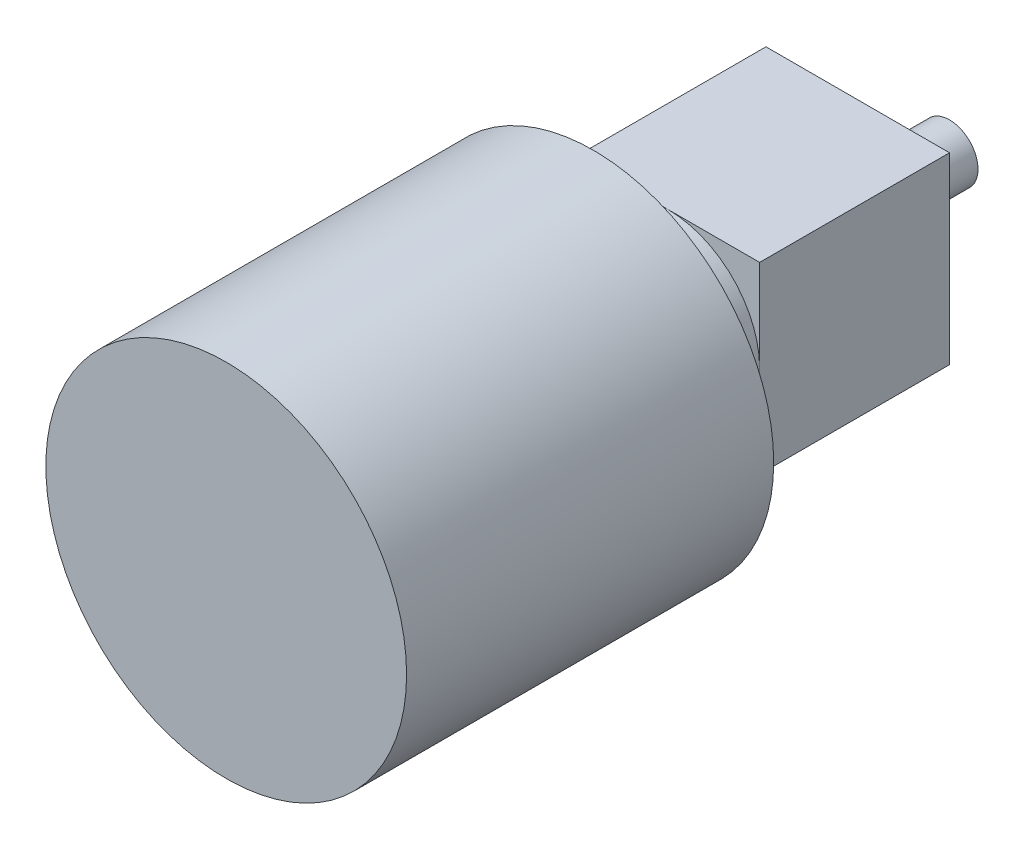
ISO-10303-21;
HEADER;
FILE_DESCRIPTION(('STEP AP214'),'2;1');
FILE_NAME('part.step','',(''),(''),'','','');
FILE_SCHEMA(('AUTOMOTIVE_DESIGN { 1 0 10303 214 1 1 1 1 }'));
ENDSEC;
DATA;
#1=APPLICATION_CONTEXT('core data for automotive mechanical design processes');
#2=APPLICATION_PROTOCOL_DEFINITION('international standard','automotive_design',2000,#1);
#3=PRODUCT_CONTEXT('',#1,'mechanical');
#4=PRODUCT('Part','Part','',(#3));
#5=PRODUCT_RELATED_PRODUCT_CATEGORY('part','',(#4));
#6=PRODUCT_DEFINITION_FORMATION('','',#4);
#7=PRODUCT_DEFINITION_CONTEXT('part definition',#1,'design');
#8=PRODUCT_DEFINITION('design','',#6,#7);
#9=PRODUCT_DEFINITION_SHAPE('','',#8);
#10=(LENGTH_UNIT() NAMED_UNIT(*) SI_UNIT(.MILLI.,.METRE.));
#11=(NAMED_UNIT(*) PLANE_ANGLE_UNIT() SI_UNIT($,.RADIAN.));
#12=(NAMED_UNIT(*) SI_UNIT($,.STERADIAN.) SOLID_ANGLE_UNIT());
#13=UNCERTAINTY_MEASURE_WITH_UNIT(LENGTH_MEASURE(1.E-05),#10,'distance_accuracy_value','');
#14=(GEOMETRIC_REPRESENTATION_CONTEXT(3) GLOBAL_UNCERTAINTY_ASSIGNED_CONTEXT((#13)) GLOBAL_UNIT_ASSIGNED_CONTEXT((#10,
#11,#12)) REPRESENTATION_CONTEXT('',''));
#15=CARTESIAN_POINT('',(0.,0.,0.));
#16=DIRECTION('',(0.,0.,1.));
#17=DIRECTION('',(1.,0.,0.));
#18=AXIS2_PLACEMENT_3D('',#15,#16,#17);
#19=CARTESIAN_POINT('',(14.5,29.,15.));
#20=DIRECTION('',(0.,0.,-1.));
#21=DIRECTION('',(-1.,0.,0.));
#22=AXIS2_PLACEMENT_3D('',#19,#20,#21);
#23=PLANE('',#22);
#24=CARTESIAN_POINT('',(0.,14.5,15.));
#25=DIRECTION('',(0.,0.,1.));
#26=DIRECTION('',(1.,0.,0.));
#27=AXIS2_PLACEMENT_3D('',#24,#25,#26);
#28=CIRCLE('',#27,14.5);
#29=CARTESIAN_POINT('',(14.5,14.5,15.));
#30=VERTEX_POINT('',#29);
#31=CARTESIAN_POINT('',(0.,29.,15.));
#32=VERTEX_POINT('',#31);
#33=EDGE_CURVE('E108',#30,#32,#28,.T.);
#34=ORIENTED_EDGE('',*,*,#33,.F.);
#35=DIRECTION('',(0.,-1.,0.));
#36=VECTOR('',#35,1.);
#37=CARTESIAN_POINT('',(14.5,29.,15.));
#38=LINE('',#37,#36);
#39=CARTESIAN_POINT('',(14.5,29.,15.));
#40=VERTEX_POINT('',#39);
#41=EDGE_CURVE('E88',#40,#30,#38,.T.);
#42=ORIENTED_EDGE('',*,*,#41,.F.);
#43=DIRECTION('',(1.,0.,0.));
#44=VECTOR('',#43,1.);
#45=CARTESIAN_POINT('',(14.5,29.,15.));
#46=LINE('',#45,#44);
#47=EDGE_CURVE('E109',#32,#40,#46,.T.);
#48=ORIENTED_EDGE('',*,*,#47,.F.);
#49=EDGE_LOOP('',(#34,#42,#48));
#50=FACE_BOUND('',#49,.T.);
#51=ADVANCED_FACE('F34',(#50),#23,.F.);
#52=CARTESIAN_POINT('',(-14.5,14.5,15.));
#53=VERTEX_POINT('',#52);
#54=EDGE_CURVE('E42',#32,#53,#28,.T.);
#55=ORIENTED_EDGE('',*,*,#54,.F.);
#56=CARTESIAN_POINT('',(-14.5,29.,15.));
#57=VERTEX_POINT('',#56);
#58=EDGE_CURVE('E124',#57,#32,#46,.T.);
#59=ORIENTED_EDGE('',*,*,#58,.F.);
#60=DIRECTION('',(0.,-1.,0.));
#61=VECTOR('',#60,1.);
#62=CARTESIAN_POINT('',(-14.5,29.,15.));
#63=LINE('',#62,#61);
#64=EDGE_CURVE('E116',#57,#53,#63,.T.);
#65=ORIENTED_EDGE('',*,*,#64,.T.);
#66=EDGE_LOOP('',(#55,#59,#65));
#67=FACE_BOUND('',#66,.T.);
#68=ADVANCED_FACE('F155',(#67),#23,.F.);
#69=CARTESIAN_POINT('',(0.,0.,15.));
#70=VERTEX_POINT('',#69);
#71=EDGE_CURVE('E49',#53,#70,#28,.T.);
#72=ORIENTED_EDGE('',*,*,#71,.F.);
#73=CARTESIAN_POINT('',(-14.5,0.,15.));
#74=VERTEX_POINT('',#73);
#75=EDGE_CURVE('E97',#53,#74,#63,.T.);
#76=ORIENTED_EDGE('',*,*,#75,.T.);
#77=DIRECTION('',(1.,0.,0.));
#78=VECTOR('',#77,1.);
#79=CARTESIAN_POINT('',(14.5,0.,15.));
#80=LINE('',#79,#78);
#81=EDGE_CURVE('E133',#74,#70,#80,.T.);
#82=ORIENTED_EDGE('',*,*,#81,.T.);
#83=EDGE_LOOP('',(#72,#76,#82));
#84=FACE_BOUND('',#83,.T.);
#85=ADVANCED_FACE('F157',(#84),#23,.F.);
#86=CARTESIAN_POINT('',(-14.5,29.,15.));
#87=DIRECTION('',(1.,0.,0.));
#88=DIRECTION('',(0.,0.,-1.));
#89=AXIS2_PLACEMENT_3D('',#86,#87,#88);
#90=PLANE('',#89);
#91=DIRECTION('',(0.,0.,1.));
#92=VECTOR('',#91,1.);
#93=CARTESIAN_POINT('',(-14.5,0.,15.));
#94=LINE('',#93,#92);
#95=CARTESIAN_POINT('',(-14.5,0.,-15.));
#96=VERTEX_POINT('',#95);
#97=EDGE_CURVE('E130',#96,#74,#94,.T.);
#98=ORIENTED_EDGE('',*,*,#97,.T.);
#99=ORIENTED_EDGE('',*,*,#75,.F.);
#100=ORIENTED_EDGE('',*,*,#64,.F.);
#101=DIRECTION('',(0.,0.,1.));
#102=VECTOR('',#101,1.);
#103=CARTESIAN_POINT('',(-14.5,29.,15.));
#104=LINE('',#103,#102);
#105=CARTESIAN_POINT('',(-14.5,29.,-15.));
#106=VERTEX_POINT('',#105);
#107=EDGE_CURVE('E120',#106,#57,#104,.T.);
#108=ORIENTED_EDGE('',*,*,#107,.F.);
#109=DIRECTION('',(0.,-1.,0.));
#110=VECTOR('',#109,1.);
#111=CARTESIAN_POINT('',(-14.5,29.,-15.));
#112=LINE('',#111,#110);
#113=EDGE_CURVE('E129',#106,#96,#112,.T.);
#114=ORIENTED_EDGE('',*,*,#113,.T.);
#115=EDGE_LOOP('',(#98,#99,#100,#108,#114));
#116=FACE_BOUND('',#115,.T.);
#117=ADVANCED_FACE('F36',(#116),#90,.F.);
#118=EDGE_CURVE('E102',#70,#30,#28,.T.);
#119=ORIENTED_EDGE('',*,*,#118,.F.);
#120=CARTESIAN_POINT('',(14.5,0.,15.));
#121=VERTEX_POINT('',#120);
#122=EDGE_CURVE('E104',#70,#121,#80,.T.);
#123=ORIENTED_EDGE('',*,*,#122,.T.);
#124=EDGE_CURVE('E91',#30,#121,#38,.T.);
#125=ORIENTED_EDGE('',*,*,#124,.F.);
#126=EDGE_LOOP('',(#119,#123,#125));
#127=FACE_BOUND('',#126,.T.);
#128=ADVANCED_FACE('F100',(#127),#23,.F.);
#129=CARTESIAN_POINT('',(14.5,29.,15.));
#130=DIRECTION('',(-1.,0.,0.));
#131=DIRECTION('',(0.,0.,1.));
#132=AXIS2_PLACEMENT_3D('',#129,#130,#131);
#133=PLANE('',#132);
#134=DIRECTION('',(0.,0.,-1.));
#135=VECTOR('',#134,1.);
#136=CARTESIAN_POINT('',(14.5,0.,15.));
#137=LINE('',#136,#135);
#138=CARTESIAN_POINT('',(14.5,0.,-15.));
#139=VERTEX_POINT('',#138);
#140=EDGE_CURVE('E135',#121,#139,#137,.T.);
#141=ORIENTED_EDGE('',*,*,#140,.T.);
#142=DIRECTION('',(0.,-1.,0.));
#143=VECTOR('',#142,1.);
#144=CARTESIAN_POINT('',(14.5,29.,-15.));
#145=LINE('',#144,#143);
#146=CARTESIAN_POINT('',(14.5,29.,-15.));
#147=VERTEX_POINT('',#146);
#148=EDGE_CURVE('E106',#147,#139,#145,.T.);
#149=ORIENTED_EDGE('',*,*,#148,.F.);
#150=DIRECTION('',(0.,0.,-1.));
#151=VECTOR('',#150,1.);
#152=CARTESIAN_POINT('',(14.5,29.,15.));
#153=LINE('',#152,#151);
#154=EDGE_CURVE('E94',#40,#147,#153,.T.);
#155=ORIENTED_EDGE('',*,*,#154,.F.);
#156=ORIENTED_EDGE('',*,*,#41,.T.);
#157=ORIENTED_EDGE('',*,*,#124,.T.);
#158=EDGE_LOOP('',(#141,#149,#155,#156,#157));
#159=FACE_BOUND('',#158,.T.);
#160=ADVANCED_FACE('F90',(#159),#133,.F.);
#161=CARTESIAN_POINT('',(14.5,29.,-15.));
#162=DIRECTION('',(0.,0.,1.));
#163=DIRECTION('',(1.,0.,0.));
#164=AXIS2_PLACEMENT_3D('',#161,#162,#163);
#165=PLANE('',#164);
#166=CARTESIAN_POINT('',(8.5,23.,-15.));
#167=DIRECTION('',(0.,0.,1.));
#168=DIRECTION('',(1.,0.,0.));
#169=AXIS2_PLACEMENT_3D('',#166,#167,#168);
#170=CIRCLE('',#169,4.5);
#171=CARTESIAN_POINT('',(13.,23.,-15.));
#172=VERTEX_POINT('',#171);
#173=EDGE_CURVE('E11',#172,#172,#170,.F.);
#174=ORIENTED_EDGE('',*,*,#173,.F.);
#175=EDGE_LOOP('',(#174));
#176=FACE_BOUND('',#175,.T.);
#177=DIRECTION('',(-1.,0.,0.));
#178=VECTOR('',#177,1.);
#179=CARTESIAN_POINT('',(14.5,0.,-15.));
#180=LINE('',#179,#178);
#181=EDGE_CURVE('E123',#139,#96,#180,.T.);
#182=ORIENTED_EDGE('',*,*,#181,.T.);
#183=ORIENTED_EDGE('',*,*,#113,.F.);
#184=DIRECTION('',(-1.,0.,0.));
#185=VECTOR('',#184,1.);
#186=CARTESIAN_POINT('',(14.5,29.,-15.));
#187=LINE('',#186,#185);
#188=EDGE_CURVE('E127',#147,#106,#187,.T.);
#189=ORIENTED_EDGE('',*,*,#188,.F.);
#190=ORIENTED_EDGE('',*,*,#148,.T.);
#191=EDGE_LOOP('',(#182,#183,#189,#190));
#192=FACE_BOUND('',#191,.T.);
#193=ADVANCED_FACE('F144',(#176,#192),#165,.F.);
#194=CARTESIAN_POINT('',(0.,29.,0.));
#195=DIRECTION('',(0.,1.,0.));
#196=DIRECTION('',(0.,0.,1.));
#197=AXIS2_PLACEMENT_3D('',#194,#195,#196);
#198=PLANE('',#197);
#199=ORIENTED_EDGE('',*,*,#107,.T.);
#200=ORIENTED_EDGE('',*,*,#58,.T.);
#201=ORIENTED_EDGE('',*,*,#47,.T.);
#202=ORIENTED_EDGE('',*,*,#154,.T.);
#203=ORIENTED_EDGE('',*,*,#188,.T.);
#204=EDGE_LOOP('',(#199,#200,#201,#202,#203));
#205=FACE_BOUND('',#204,.T.);
#206=ADVANCED_FACE('F154',(#205),#198,.T.);
#207=CARTESIAN_POINT('',(0.,0.,0.));
#208=DIRECTION('',(0.,1.,0.));
#209=DIRECTION('',(0.,0.,1.));
#210=AXIS2_PLACEMENT_3D('',#207,#208,#209);
#211=PLANE('',#210);
#212=CARTESIAN_POINT('',(10.,0.,12.));
#213=DIRECTION('',(0.,-1.,0.));
#214=DIRECTION('',(0.,0.,-1.));
#215=AXIS2_PLACEMENT_3D('',#212,#213,#214);
#216=CIRCLE('',#215,1.2);
#217=CARTESIAN_POINT('',(10.,0.,10.8));
#218=VERTEX_POINT('',#217);
#219=EDGE_CURVE('E238',#218,#218,#216,.T.);
#220=ORIENTED_EDGE('',*,*,#219,.F.);
#221=EDGE_LOOP('',(#220));
#222=FACE_BOUND('',#221,.T.);
#223=CARTESIAN_POINT('',(0.,0.,-11.5));
#224=DIRECTION('',(0.,-1.,0.));
#225=DIRECTION('',(0.,0.,-1.));
#226=AXIS2_PLACEMENT_3D('',#223,#224,#225);
#227=CIRCLE('',#226,1.2);
#228=CARTESIAN_POINT('',(0.,0.,-12.7));
#229=VERTEX_POINT('',#228);
#230=EDGE_CURVE('E229',#229,#229,#227,.T.);
#231=ORIENTED_EDGE('',*,*,#230,.F.);
#232=EDGE_LOOP('',(#231));
#233=FACE_BOUND('',#232,.T.);
#234=CARTESIAN_POINT('',(-10.,0.,12.));
#235=DIRECTION('',(0.,-1.,0.));
#236=DIRECTION('',(0.,0.,-1.));
#237=AXIS2_PLACEMENT_3D('',#234,#235,#236);
#238=CIRCLE('',#237,1.2);
#239=CARTESIAN_POINT('',(-10.,0.,10.8));
#240=VERTEX_POINT('',#239);
#241=EDGE_CURVE('E237',#240,#240,#238,.T.);
#242=ORIENTED_EDGE('',*,*,#241,.F.);
#243=EDGE_LOOP('',(#242));
#244=FACE_BOUND('',#243,.T.);
#245=ORIENTED_EDGE('',*,*,#97,.F.);
#246=ORIENTED_EDGE('',*,*,#181,.F.);
#247=ORIENTED_EDGE('',*,*,#140,.F.);
#248=ORIENTED_EDGE('',*,*,#122,.F.);
#249=ORIENTED_EDGE('',*,*,#81,.F.);
#250=EDGE_LOOP('',(#245,#246,#247,#248,#249));
#251=FACE_BOUND('',#250,.T.);
#252=ADVANCED_FACE('F148',(#222,#233,#244,#251),#211,.F.);
#253=CARTESIAN_POINT('',(0.,14.5,26.78));
#254=DIRECTION('',(0.,0.,-1.));
#255=DIRECTION('',(-1.,0.,0.));
#256=AXIS2_PLACEMENT_3D('',#253,#254,#255);
#257=CYLINDRICAL_SURFACE('',#256,14.5);
#258=CARTESIAN_POINT('',(0.,14.5,26.78));
#259=DIRECTION('',(0.,0.,1.));
#260=DIRECTION('',(1.,0.,0.));
#261=AXIS2_PLACEMENT_3D('',#258,#259,#260);
#262=CIRCLE('',#261,14.5);
#263=CARTESIAN_POINT('',(14.5,14.5,26.78));
#264=VERTEX_POINT('',#263);
#265=EDGE_CURVE('E112',#264,#264,#262,.T.);
#266=ORIENTED_EDGE('',*,*,#265,.F.);
#267=EDGE_LOOP('',(#266));
#268=FACE_BOUND('',#267,.T.);
#269=ORIENTED_EDGE('',*,*,#33,.T.);
#270=ORIENTED_EDGE('',*,*,#54,.T.);
#271=ORIENTED_EDGE('',*,*,#71,.T.);
#272=ORIENTED_EDGE('',*,*,#118,.T.);
#273=EDGE_LOOP('',(#269,#270,#271,#272));
#274=FACE_BOUND('',#273,.T.);
#275=ADVANCED_FACE('F115',(#268,#274),#257,.T.);
#276=CARTESIAN_POINT('',(-10.,2.5,12.));
#277=DIRECTION('',(0.,-1.,0.));
#278=DIRECTION('',(0.,0.,-1.));
#279=AXIS2_PLACEMENT_3D('',#276,#277,#278);
#280=CYLINDRICAL_SURFACE('',#279,1.2);
#281=CARTESIAN_POINT('',(-10.,2.5,12.));
#282=DIRECTION('',(0.,-1.,0.));
#283=DIRECTION('',(0.,0.,-1.));
#284=AXIS2_PLACEMENT_3D('',#281,#282,#283);
#285=CIRCLE('',#284,1.2);
#286=CARTESIAN_POINT('',(-10.,2.5,10.8));
#287=VERTEX_POINT('',#286);
#288=EDGE_CURVE('E113',#287,#287,#285,.T.);
#289=ORIENTED_EDGE('',*,*,#288,.F.);
#290=EDGE_LOOP('',(#289));
#291=FACE_BOUND('',#290,.T.);
#292=ORIENTED_EDGE('',*,*,#241,.T.);
#293=EDGE_LOOP('',(#292));
#294=FACE_BOUND('',#293,.T.);
#295=ADVANCED_FACE('F176',(#291,#294),#280,.F.);
#296=CARTESIAN_POINT('',(-10.,2.5,12.));
#297=DIRECTION('',(0.,-1.,0.));
#298=DIRECTION('',(0.,0.,-1.));
#299=AXIS2_PLACEMENT_3D('',#296,#297,#298);
#300=PLANE('',#299);
#301=ORIENTED_EDGE('',*,*,#288,.T.);
#302=EDGE_LOOP('',(#301));
#303=FACE_BOUND('',#302,.T.);
#304=ADVANCED_FACE('F180',(#303),#300,.T.);
#305=CARTESIAN_POINT('',(0.,2.5,-11.5));
#306=DIRECTION('',(0.,-1.,0.));
#307=DIRECTION('',(0.,0.,-1.));
#308=AXIS2_PLACEMENT_3D('',#305,#306,#307);
#309=CYLINDRICAL_SURFACE('',#308,1.2);
#310=CARTESIAN_POINT('',(0.,2.5,-11.5));
#311=DIRECTION('',(0.,-1.,0.));
#312=DIRECTION('',(0.,0.,-1.));
#313=AXIS2_PLACEMENT_3D('',#310,#311,#312);
#314=CIRCLE('',#313,1.2);
#315=CARTESIAN_POINT('',(0.,2.5,-12.7));
#316=VERTEX_POINT('',#315);
#317=EDGE_CURVE('E241',#316,#316,#314,.T.);
#318=ORIENTED_EDGE('',*,*,#317,.F.);
#319=EDGE_LOOP('',(#318));
#320=FACE_BOUND('',#319,.T.);
#321=ORIENTED_EDGE('',*,*,#230,.T.);
#322=EDGE_LOOP('',(#321));
#323=FACE_BOUND('',#322,.T.);
#324=ADVANCED_FACE('F184',(#320,#323),#309,.F.);
#325=CARTESIAN_POINT('',(0.,2.5,-11.5));
#326=DIRECTION('',(0.,-1.,0.));
#327=DIRECTION('',(0.,0.,-1.));
#328=AXIS2_PLACEMENT_3D('',#325,#326,#327);
#329=PLANE('',#328);
#330=ORIENTED_EDGE('',*,*,#317,.T.);
#331=EDGE_LOOP('',(#330));
#332=FACE_BOUND('',#331,.T.);
#333=ADVANCED_FACE('F188',(#332),#329,.T.);
#334=CARTESIAN_POINT('',(10.,2.5,12.));
#335=DIRECTION('',(0.,-1.,0.));
#336=DIRECTION('',(0.,0.,-1.));
#337=AXIS2_PLACEMENT_3D('',#334,#335,#336);
#338=CYLINDRICAL_SURFACE('',#337,1.2);
#339=CARTESIAN_POINT('',(10.,2.5,12.));
#340=DIRECTION('',(0.,-1.,0.));
#341=DIRECTION('',(0.,0.,-1.));
#342=AXIS2_PLACEMENT_3D('',#339,#340,#341);
#343=CIRCLE('',#342,1.2);
#344=CARTESIAN_POINT('',(10.,2.5,10.8));
#345=VERTEX_POINT('',#344);
#346=EDGE_CURVE('E234',#345,#345,#343,.T.);
#347=ORIENTED_EDGE('',*,*,#346,.F.);
#348=EDGE_LOOP('',(#347));
#349=FACE_BOUND('',#348,.T.);
#350=ORIENTED_EDGE('',*,*,#219,.T.);
#351=EDGE_LOOP('',(#350));
#352=FACE_BOUND('',#351,.T.);
#353=ADVANCED_FACE('F192',(#349,#352),#338,.F.);
#354=CARTESIAN_POINT('',(10.,2.5,12.));
#355=DIRECTION('',(0.,-1.,0.));
#356=DIRECTION('',(0.,0.,-1.));
#357=AXIS2_PLACEMENT_3D('',#354,#355,#356);
#358=PLANE('',#357);
#359=ORIENTED_EDGE('',*,*,#346,.T.);
#360=EDGE_LOOP('',(#359));
#361=FACE_BOUND('',#360,.T.);
#362=ADVANCED_FACE('F196',(#361),#358,.T.);
#363=CARTESIAN_POINT('',(8.5,23.,-21.));
#364=DIRECTION('',(0.,0.,1.));
#365=DIRECTION('',(1.,0.,0.));
#366=AXIS2_PLACEMENT_3D('',#363,#364,#365);
#367=CYLINDRICAL_SURFACE('',#366,4.5);
#368=CARTESIAN_POINT('',(8.5,23.,-21.));
#369=DIRECTION('',(0.,0.,-1.));
#370=DIRECTION('',(-1.,0.,0.));
#371=AXIS2_PLACEMENT_3D('',#368,#369,#370);
#372=CIRCLE('',#371,4.5);
#373=CARTESIAN_POINT('',(4.,23.,-21.));
#374=VERTEX_POINT('',#373);
#375=EDGE_CURVE('E225',#374,#374,#372,.T.);
#376=ORIENTED_EDGE('',*,*,#375,.F.);
#377=EDGE_LOOP('',(#376));
#378=FACE_BOUND('',#377,.T.);
#379=ORIENTED_EDGE('',*,*,#173,.T.);
#380=EDGE_LOOP('',(#379));
#381=FACE_BOUND('',#380,.T.);
#382=ADVANCED_FACE('F200',(#378,#381),#367,.T.);
#383=CARTESIAN_POINT('',(8.5,23.,-21.));
#384=DIRECTION('',(0.,0.,-1.));
#385=DIRECTION('',(-1.,0.,0.));
#386=AXIS2_PLACEMENT_3D('',#383,#384,#385);
#387=PLANE('',#386);
#388=ORIENTED_EDGE('',*,*,#375,.T.);
#389=EDGE_LOOP('',(#388));
#390=FACE_BOUND('',#389,.T.);
#391=ADVANCED_FACE('F204',(#390),#387,.T.);
#392=CARTESIAN_POINT('',(0.,14.5,84.78));
#393=DIRECTION('',(0.,0.,-1.));
#394=DIRECTION('',(-1.,0.,0.));
#395=AXIS2_PLACEMENT_3D('',#392,#393,#394);
#396=CYLINDRICAL_SURFACE('',#395,28.5);
#397=CARTESIAN_POINT('',(0.,14.5,84.78));
#398=DIRECTION('',(0.,0.,1.));
#399=DIRECTION('',(1.,0.,0.));
#400=AXIS2_PLACEMENT_3D('',#397,#398,#399);
#401=CIRCLE('',#400,28.5);
#402=CARTESIAN_POINT('',(28.5,14.5,84.78));
#403=VERTEX_POINT('',#402);
#404=EDGE_CURVE('E224',#403,#403,#401,.T.);
#405=ORIENTED_EDGE('',*,*,#404,.F.);
#406=EDGE_LOOP('',(#405));
#407=FACE_BOUND('',#406,.T.);
#408=CARTESIAN_POINT('',(0.,14.5,26.78));
#409=DIRECTION('',(0.,0.,1.));
#410=DIRECTION('',(1.,0.,0.));
#411=AXIS2_PLACEMENT_3D('',#408,#409,#410);
#412=CIRCLE('',#411,28.5);
#413=CARTESIAN_POINT('',(28.5,14.5,26.78));
#414=VERTEX_POINT('',#413);
#415=EDGE_CURVE('E226',#414,#414,#412,.T.);
#416=ORIENTED_EDGE('',*,*,#415,.T.);
#417=EDGE_LOOP('',(#416));
#418=FACE_BOUND('',#417,.T.);
#419=ADVANCED_FACE('F208',(#407,#418),#396,.T.);
#420=CARTESIAN_POINT('',(0.,14.5,84.78));
#421=DIRECTION('',(0.,0.,1.));
#422=DIRECTION('',(1.,0.,0.));
#423=AXIS2_PLACEMENT_3D('',#420,#421,#422);
#424=PLANE('',#423);
#425=ORIENTED_EDGE('',*,*,#404,.T.);
#426=EDGE_LOOP('',(#425));
#427=FACE_BOUND('',#426,.T.);
#428=ADVANCED_FACE('F212',(#427),#424,.T.);
#429=CARTESIAN_POINT('',(0.,14.5,26.78));
#430=DIRECTION('',(0.,0.,1.));
#431=DIRECTION('',(1.,0.,0.));
#432=AXIS2_PLACEMENT_3D('',#429,#430,#431);
#433=PLANE('',#432);
#434=ORIENTED_EDGE('',*,*,#265,.T.);
#435=EDGE_LOOP('',(#434));
#436=FACE_BOUND('',#435,.T.);
#437=ORIENTED_EDGE('',*,*,#415,.F.);
#438=EDGE_LOOP('',(#437));
#439=FACE_BOUND('',#438,.T.);
#440=ADVANCED_FACE('F214',(#436,#439),#433,.F.);
#441=CLOSED_SHELL('',(#51,#68,#85,#117,#128,#160,#193,#206,#252,#275,#295,#304,#324,#333,#353,
#362,#382,#391,#419,#428,#440));
#442=MANIFOLD_SOLID_BREP('B2',#441);
#443=ADVANCED_BREP_SHAPE_REPRESENTATION('',(#18,#442),#14);
#444=SHAPE_DEFINITION_REPRESENTATION(#9,#443);
ENDSEC;
END-ISO-10303-21;
